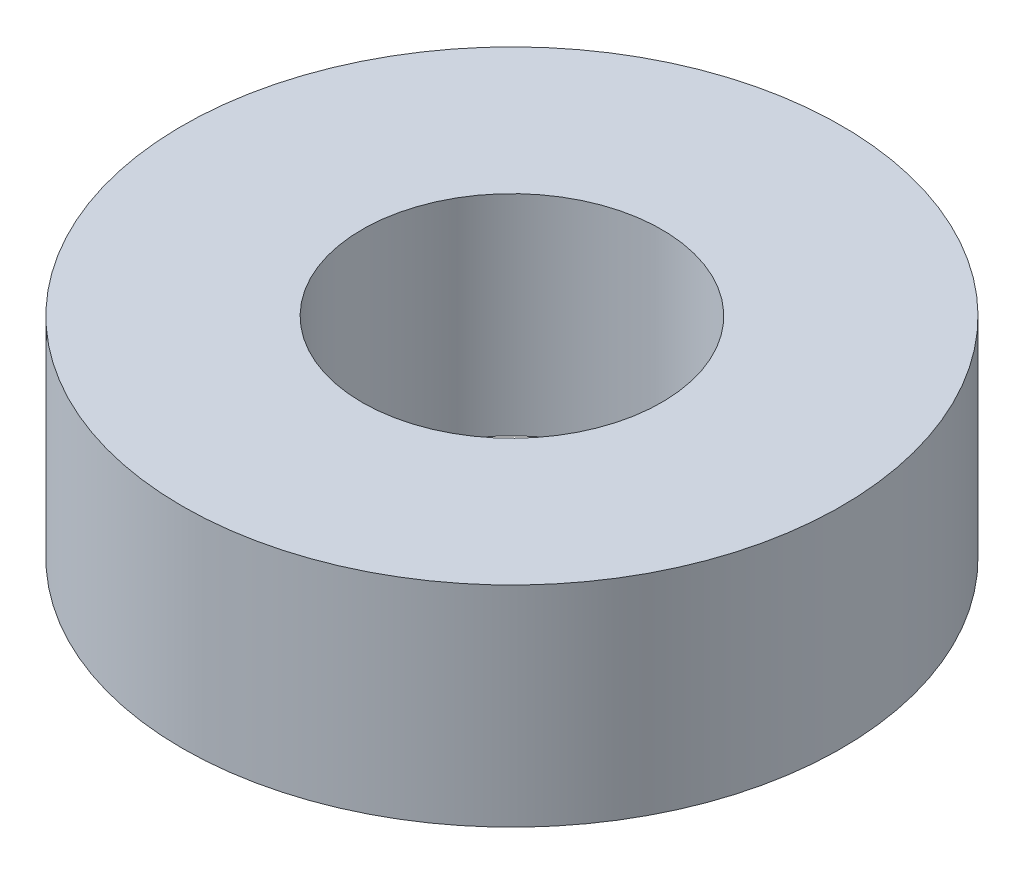
ISO-10303-21;
HEADER;
FILE_DESCRIPTION(('STEP AP214'),'2;1');
FILE_NAME('part.step','',(''),(''),'','','');
FILE_SCHEMA(('AUTOMOTIVE_DESIGN { 1 0 10303 214 1 1 1 1 }'));
ENDSEC;
DATA;
#1=APPLICATION_CONTEXT('core data for automotive mechanical design processes');
#2=APPLICATION_PROTOCOL_DEFINITION('international standard','automotive_design',2000,#1);
#3=PRODUCT_CONTEXT('',#1,'mechanical');
#4=PRODUCT('Part','Part','',(#3));
#5=PRODUCT_RELATED_PRODUCT_CATEGORY('part','',(#4));
#6=PRODUCT_DEFINITION_FORMATION('','',#4);
#7=PRODUCT_DEFINITION_CONTEXT('part definition',#1,'design');
#8=PRODUCT_DEFINITION('design','',#6,#7);
#9=PRODUCT_DEFINITION_SHAPE('','',#8);
#10=(LENGTH_UNIT() NAMED_UNIT(*) SI_UNIT(.MILLI.,.METRE.));
#11=(NAMED_UNIT(*) PLANE_ANGLE_UNIT() SI_UNIT($,.RADIAN.));
#12=(NAMED_UNIT(*) SI_UNIT($,.STERADIAN.) SOLID_ANGLE_UNIT());
#13=UNCERTAINTY_MEASURE_WITH_UNIT(LENGTH_MEASURE(1.E-05),#10,'distance_accuracy_value','');
#14=(GEOMETRIC_REPRESENTATION_CONTEXT(3) GLOBAL_UNCERTAINTY_ASSIGNED_CONTEXT((#13)) GLOBAL_UNIT_ASSIGNED_CONTEXT((#10,
#11,#12)) REPRESENTATION_CONTEXT('',''));
#15=CARTESIAN_POINT('',(0.,0.,0.));
#16=DIRECTION('',(0.,0.,1.));
#17=DIRECTION('',(1.,0.,0.));
#18=AXIS2_PLACEMENT_3D('',#15,#16,#17);
#19=CARTESIAN_POINT('',(0.,11.1125,0.));
#20=DIRECTION('',(0.,1.,0.));
#21=DIRECTION('',(0.,0.,1.));
#22=AXIS2_PLACEMENT_3D('',#19,#20,#21);
#23=PLANE('',#22);
#24=CARTESIAN_POINT('',(0.,11.1125,0.));
#25=DIRECTION('',(0.,1.,0.));
#26=DIRECTION('',(0.,0.,1.));
#27=AXIS2_PLACEMENT_3D('',#24,#25,#26);
#28=CIRCLE('',#27,17.4625);
#29=CARTESIAN_POINT('',(0.,11.1125,17.4625));
#30=VERTEX_POINT('',#29);
#31=EDGE_CURVE('E10',#30,#30,#28,.T.);
#32=ORIENTED_EDGE('',*,*,#31,.T.);
#33=EDGE_LOOP('',(#32));
#34=FACE_BOUND('',#33,.T.);
#35=CARTESIAN_POINT('',(0.,11.1125,0.));
#36=DIRECTION('',(0.,1.,0.));
#37=DIRECTION('',(0.,0.,1.));
#38=AXIS2_PLACEMENT_3D('',#35,#36,#37);
#39=CIRCLE('',#38,7.9375);
#40=CARTESIAN_POINT('',(0.,11.1125,7.9375));
#41=VERTEX_POINT('',#40);
#42=EDGE_CURVE('E56',#41,#41,#39,.T.);
#43=ORIENTED_EDGE('',*,*,#42,.F.);
#44=EDGE_LOOP('',(#43));
#45=FACE_BOUND('',#44,.T.);
#46=ADVANCED_FACE('F43',(#34,#45),#23,.T.);
#47=CARTESIAN_POINT('',(0.,0.,0.));
#48=DIRECTION('',(0.,1.,0.));
#49=DIRECTION('',(0.,0.,1.));
#50=AXIS2_PLACEMENT_3D('',#47,#48,#49);
#51=PLANE('',#50);
#52=CARTESIAN_POINT('',(0.,0.,0.));
#53=DIRECTION('',(0.,1.,0.));
#54=DIRECTION('',(0.,0.,1.));
#55=AXIS2_PLACEMENT_3D('',#52,#53,#54);
#56=CIRCLE('',#55,17.4625);
#57=CARTESIAN_POINT('',(0.,0.,17.4625));
#58=VERTEX_POINT('',#57);
#59=EDGE_CURVE('E47',#58,#58,#56,.T.);
#60=ORIENTED_EDGE('',*,*,#59,.F.);
#61=EDGE_LOOP('',(#60));
#62=FACE_BOUND('',#61,.T.);
#63=CARTESIAN_POINT('',(0.,0.,0.));
#64=DIRECTION('',(0.,1.,0.));
#65=DIRECTION('',(0.,0.,1.));
#66=AXIS2_PLACEMENT_3D('',#63,#64,#65);
#67=CIRCLE('',#66,7.9375);
#68=CARTESIAN_POINT('',(0.,0.,7.9375));
#69=VERTEX_POINT('',#68);
#70=EDGE_CURVE('E58',#69,#69,#67,.T.);
#71=ORIENTED_EDGE('',*,*,#70,.T.);
#72=EDGE_LOOP('',(#71));
#73=FACE_BOUND('',#72,.T.);
#74=ADVANCED_FACE('F70',(#62,#73),#51,.F.);
#75=CARTESIAN_POINT('',(0.,11.1125,0.));
#76=DIRECTION('',(0.,-1.,0.));
#77=DIRECTION('',(0.,0.,-1.));
#78=AXIS2_PLACEMENT_3D('',#75,#76,#77);
#79=CYLINDRICAL_SURFACE('',#78,17.4625);
#80=ORIENTED_EDGE('',*,*,#31,.F.);
#81=EDGE_LOOP('',(#80));
#82=FACE_BOUND('',#81,.T.);
#83=ORIENTED_EDGE('',*,*,#59,.T.);
#84=EDGE_LOOP('',(#83));
#85=FACE_BOUND('',#84,.T.);
#86=ADVANCED_FACE('F45',(#82,#85),#79,.T.);
#87=CARTESIAN_POINT('',(0.,11.1125,0.));
#88=DIRECTION('',(0.,-1.,0.));
#89=DIRECTION('',(0.,0.,-1.));
#90=AXIS2_PLACEMENT_3D('',#87,#88,#89);
#91=CYLINDRICAL_SURFACE('',#90,7.9375);
#92=ORIENTED_EDGE('',*,*,#42,.T.);
#93=EDGE_LOOP('',(#92));
#94=FACE_BOUND('',#93,.T.);
#95=ORIENTED_EDGE('',*,*,#70,.F.);
#96=EDGE_LOOP('',(#95));
#97=FACE_BOUND('',#96,.T.);
#98=ADVANCED_FACE('F66',(#94,#97),#91,.F.);
#99=CLOSED_SHELL('',(#46,#74,#86,#98));
#100=MANIFOLD_SOLID_BREP('B2',#99);
#101=ADVANCED_BREP_SHAPE_REPRESENTATION('',(#18,#100),#14);
#102=SHAPE_DEFINITION_REPRESENTATION(#9,#101);
ENDSEC;
END-ISO-10303-21;
